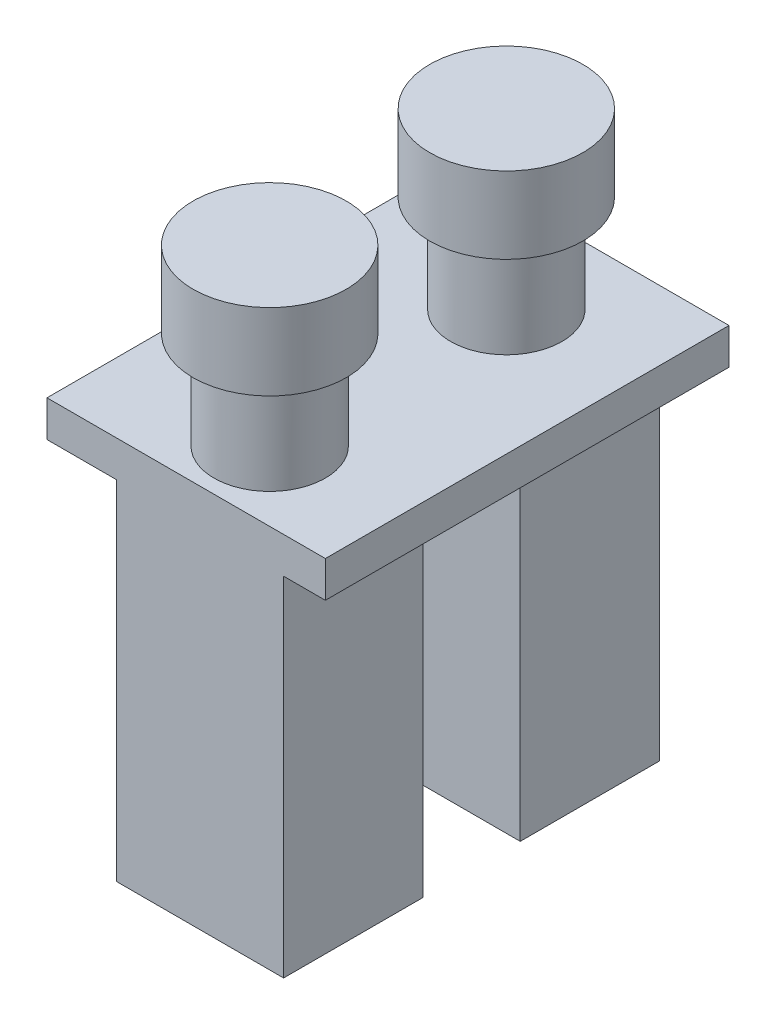
ISO-10303-21;
HEADER;
FILE_DESCRIPTION(('STEP AP214'),'2;1');
FILE_NAME('part.step','',(''),(''),'','','');
FILE_SCHEMA(('AUTOMOTIVE_DESIGN { 1 0 10303 214 1 1 1 1 }'));
ENDSEC;
DATA;
#1=APPLICATION_CONTEXT('core data for automotive mechanical design processes');
#2=APPLICATION_PROTOCOL_DEFINITION('international standard','automotive_design',2000,#1);
#3=PRODUCT_CONTEXT('',#1,'mechanical');
#4=PRODUCT('Part','Part','',(#3));
#5=PRODUCT_RELATED_PRODUCT_CATEGORY('part','',(#4));
#6=PRODUCT_DEFINITION_FORMATION('','',#4);
#7=PRODUCT_DEFINITION_CONTEXT('part definition',#1,'design');
#8=PRODUCT_DEFINITION('design','',#6,#7);
#9=PRODUCT_DEFINITION_SHAPE('','',#8);
#10=(LENGTH_UNIT() NAMED_UNIT(*) SI_UNIT(.MILLI.,.METRE.));
#11=(NAMED_UNIT(*) PLANE_ANGLE_UNIT() SI_UNIT($,.RADIAN.));
#12=(NAMED_UNIT(*) SI_UNIT($,.STERADIAN.) SOLID_ANGLE_UNIT());
#13=UNCERTAINTY_MEASURE_WITH_UNIT(LENGTH_MEASURE(1.E-05),#10,'distance_accuracy_value','');
#14=(GEOMETRIC_REPRESENTATION_CONTEXT(3) GLOBAL_UNCERTAINTY_ASSIGNED_CONTEXT((#13)) GLOBAL_UNIT_ASSIGNED_CONTEXT((#10,
#11,#12)) REPRESENTATION_CONTEXT('',''));
#15=CARTESIAN_POINT('',(0.,0.,0.));
#16=DIRECTION('',(0.,0.,1.));
#17=DIRECTION('',(1.,0.,0.));
#18=AXIS2_PLACEMENT_3D('',#15,#16,#17);
#19=CARTESIAN_POINT('',(0.,0.,0.));
#20=DIRECTION('',(0.,-1.,0.));
#21=DIRECTION('',(0.,0.,-1.));
#22=AXIS2_PLACEMENT_3D('',#19,#20,#21);
#23=PLANE('',#22);
#24=DIRECTION('',(1.,0.,0.));
#25=VECTOR('',#24,1.);
#26=CARTESIAN_POINT('',(5.,0.,-27.));
#27=LINE('',#26,#25);
#28=CARTESIAN_POINT('',(5.,0.,-27.));
#29=VERTEX_POINT('',#28);
#30=CARTESIAN_POINT('',(17.,0.,-27.));
#31=VERTEX_POINT('',#30);
#32=EDGE_CURVE('E162',#29,#31,#27,.T.);
#33=ORIENTED_EDGE('',*,*,#32,.F.);
#34=DIRECTION('',(0.,0.,-1.));
#35=VECTOR('',#34,1.);
#36=CARTESIAN_POINT('',(5.,0.,-27.));
#37=LINE('',#36,#35);
#38=CARTESIAN_POINT('',(5.,0.,-17.));
#39=VERTEX_POINT('',#38);
#40=EDGE_CURVE('E157',#39,#29,#37,.T.);
#41=ORIENTED_EDGE('',*,*,#40,.F.);
#42=DIRECTION('',(-1.,0.,0.));
#43=VECTOR('',#42,1.);
#44=CARTESIAN_POINT('',(5.,0.,-17.));
#45=LINE('',#44,#43);
#46=CARTESIAN_POINT('',(17.,0.,-17.));
#47=VERTEX_POINT('',#46);
#48=EDGE_CURVE('E172',#47,#39,#45,.T.);
#49=ORIENTED_EDGE('',*,*,#48,.F.);
#50=DIRECTION('',(0.,0.,1.));
#51=VECTOR('',#50,1.);
#52=CARTESIAN_POINT('',(17.,0.,-27.));
#53=LINE('',#52,#51);
#54=EDGE_CURVE('E184',#31,#47,#53,.T.);
#55=ORIENTED_EDGE('',*,*,#54,.F.);
#56=EDGE_LOOP('',(#33,#41,#49,#55));
#57=FACE_BOUND('',#56,.T.);
#58=DIRECTION('',(1.,0.,0.));
#59=VECTOR('',#58,1.);
#60=CARTESIAN_POINT('',(5.,0.,-10.));
#61=LINE('',#60,#59);
#62=CARTESIAN_POINT('',(5.,0.,-10.));
#63=VERTEX_POINT('',#62);
#64=CARTESIAN_POINT('',(17.,0.,-10.));
#65=VERTEX_POINT('',#64);
#66=EDGE_CURVE('E298',#63,#65,#61,.T.);
#67=ORIENTED_EDGE('',*,*,#66,.F.);
#68=DIRECTION('',(0.,0.,-1.));
#69=VECTOR('',#68,1.);
#70=CARTESIAN_POINT('',(5.,0.,-10.));
#71=LINE('',#70,#69);
#72=CARTESIAN_POINT('',(5.,0.,0.));
#73=VERTEX_POINT('',#72);
#74=EDGE_CURVE('E154',#73,#63,#71,.T.);
#75=ORIENTED_EDGE('',*,*,#74,.F.);
#76=DIRECTION('',(1.,0.,0.));
#77=VECTOR('',#76,1.);
#78=CARTESIAN_POINT('',(0.,0.,0.));
#79=LINE('',#78,#77);
#80=CARTESIAN_POINT('',(0.,0.,0.));
#81=VERTEX_POINT('',#80);
#82=EDGE_CURVE('E245',#81,#73,#79,.T.);
#83=ORIENTED_EDGE('',*,*,#82,.F.);
#84=DIRECTION('',(0.,0.,1.));
#85=VECTOR('',#84,1.);
#86=CARTESIAN_POINT('',(0.,0.,0.));
#87=LINE('',#86,#85);
#88=CARTESIAN_POINT('',(0.,0.,-29.));
#89=VERTEX_POINT('',#88);
#90=EDGE_CURVE('E225',#89,#81,#87,.T.);
#91=ORIENTED_EDGE('',*,*,#90,.F.);
#92=DIRECTION('',(-1.,0.,0.));
#93=VECTOR('',#92,1.);
#94=CARTESIAN_POINT('',(0.,0.,-29.));
#95=LINE('',#94,#93);
#96=CARTESIAN_POINT('',(20.,0.,-29.));
#97=VERTEX_POINT('',#96);
#98=EDGE_CURVE('E231',#97,#89,#95,.T.);
#99=ORIENTED_EDGE('',*,*,#98,.F.);
#100=DIRECTION('',(0.,0.,-1.));
#101=VECTOR('',#100,1.);
#102=CARTESIAN_POINT('',(20.,0.,0.));
#103=LINE('',#102,#101);
#104=CARTESIAN_POINT('',(20.,0.,0.));
#105=VERTEX_POINT('',#104);
#106=EDGE_CURVE('E249',#105,#97,#103,.T.);
#107=ORIENTED_EDGE('',*,*,#106,.F.);
#108=CARTESIAN_POINT('',(17.,0.,0.));
#109=VERTEX_POINT('',#108);
#110=EDGE_CURVE('E244',#109,#105,#79,.T.);
#111=ORIENTED_EDGE('',*,*,#110,.F.);
#112=DIRECTION('',(0.,0.,1.));
#113=VECTOR('',#112,1.);
#114=CARTESIAN_POINT('',(17.,0.,-10.));
#115=LINE('',#114,#113);
#116=EDGE_CURVE('E150',#65,#109,#115,.T.);
#117=ORIENTED_EDGE('',*,*,#116,.F.);
#118=EDGE_LOOP('',(#67,#75,#83,#91,#99,#107,#111,#117));
#119=FACE_BOUND('',#118,.T.);
#120=ADVANCED_FACE('F39',(#57,#119),#23,.T.);
#121=CARTESIAN_POINT('',(0.,2.6,0.));
#122=DIRECTION('',(1.,0.,0.));
#123=DIRECTION('',(0.,0.,-1.));
#124=AXIS2_PLACEMENT_3D('',#121,#122,#123);
#125=PLANE('',#124);
#126=ORIENTED_EDGE('',*,*,#90,.T.);
#127=DIRECTION('',(0.,-1.,0.));
#128=VECTOR('',#127,1.);
#129=CARTESIAN_POINT('',(0.,2.6,0.));
#130=LINE('',#129,#128);
#131=CARTESIAN_POINT('',(0.,2.6,0.));
#132=VERTEX_POINT('',#131);
#133=EDGE_CURVE('E265',#132,#81,#130,.T.);
#134=ORIENTED_EDGE('',*,*,#133,.F.);
#135=DIRECTION('',(0.,0.,1.));
#136=VECTOR('',#135,1.);
#137=CARTESIAN_POINT('',(0.,2.6,0.));
#138=LINE('',#137,#136);
#139=CARTESIAN_POINT('',(0.,2.6,-29.));
#140=VERTEX_POINT('',#139);
#141=EDGE_CURVE('E226',#140,#132,#138,.T.);
#142=ORIENTED_EDGE('',*,*,#141,.F.);
#143=DIRECTION('',(0.,-1.,0.));
#144=VECTOR('',#143,1.);
#145=CARTESIAN_POINT('',(0.,2.6,-29.));
#146=LINE('',#145,#144);
#147=EDGE_CURVE('E240',#140,#89,#146,.T.);
#148=ORIENTED_EDGE('',*,*,#147,.T.);
#149=EDGE_LOOP('',(#126,#134,#142,#148));
#150=FACE_BOUND('',#149,.T.);
#151=ADVANCED_FACE('F41',(#150),#125,.F.);
#152=CARTESIAN_POINT('',(0.,2.6,0.));
#153=DIRECTION('',(0.,0.,-1.));
#154=DIRECTION('',(-1.,0.,0.));
#155=AXIS2_PLACEMENT_3D('',#152,#153,#154);
#156=PLANE('',#155);
#157=ORIENTED_EDGE('',*,*,#82,.T.);
#158=DIRECTION('',(0.,1.,0.));
#159=VECTOR('',#158,1.);
#160=CARTESIAN_POINT('',(5.,-25.,0.));
#161=LINE('',#160,#159);
#162=CARTESIAN_POINT('',(5.,-25.,0.));
#163=VERTEX_POINT('',#162);
#164=EDGE_CURVE('E308',#163,#73,#161,.T.);
#165=ORIENTED_EDGE('',*,*,#164,.F.);
#166=DIRECTION('',(-1.,0.,0.));
#167=VECTOR('',#166,1.);
#168=CARTESIAN_POINT('',(5.,-25.,0.));
#169=LINE('',#168,#167);
#170=CARTESIAN_POINT('',(17.,-25.,0.));
#171=VERTEX_POINT('',#170);
#172=EDGE_CURVE('E146',#171,#163,#169,.T.);
#173=ORIENTED_EDGE('',*,*,#172,.F.);
#174=DIRECTION('',(0.,1.,0.));
#175=VECTOR('',#174,1.);
#176=CARTESIAN_POINT('',(17.,-25.,0.));
#177=LINE('',#176,#175);
#178=EDGE_CURVE('E55',#171,#109,#177,.T.);
#179=ORIENTED_EDGE('',*,*,#178,.T.);
#180=ORIENTED_EDGE('',*,*,#110,.T.);
#181=DIRECTION('',(0.,-1.,0.));
#182=VECTOR('',#181,1.);
#183=CARTESIAN_POINT('',(20.,2.6,0.));
#184=LINE('',#183,#182);
#185=CARTESIAN_POINT('',(20.,2.6,0.));
#186=VERTEX_POINT('',#185);
#187=EDGE_CURVE('E261',#186,#105,#184,.T.);
#188=ORIENTED_EDGE('',*,*,#187,.F.);
#189=DIRECTION('',(1.,0.,0.));
#190=VECTOR('',#189,1.);
#191=CARTESIAN_POINT('',(0.,2.6,0.));
#192=LINE('',#191,#190);
#193=EDGE_CURVE('E230',#132,#186,#192,.T.);
#194=ORIENTED_EDGE('',*,*,#193,.F.);
#195=ORIENTED_EDGE('',*,*,#133,.T.);
#196=EDGE_LOOP('',(#157,#165,#173,#179,#180,#188,#194,#195));
#197=FACE_BOUND('',#196,.T.);
#198=ADVANCED_FACE('F287',(#197),#156,.F.);
#199=CARTESIAN_POINT('',(20.,2.6,0.));
#200=DIRECTION('',(-1.,0.,0.));
#201=DIRECTION('',(0.,0.,1.));
#202=AXIS2_PLACEMENT_3D('',#199,#200,#201);
#203=PLANE('',#202);
#204=ORIENTED_EDGE('',*,*,#106,.T.);
#205=DIRECTION('',(0.,-1.,0.));
#206=VECTOR('',#205,1.);
#207=CARTESIAN_POINT('',(20.,2.6,-29.));
#208=LINE('',#207,#206);
#209=CARTESIAN_POINT('',(20.,2.6,-29.));
#210=VERTEX_POINT('',#209);
#211=EDGE_CURVE('E257',#210,#97,#208,.T.);
#212=ORIENTED_EDGE('',*,*,#211,.F.);
#213=DIRECTION('',(0.,0.,-1.));
#214=VECTOR('',#213,1.);
#215=CARTESIAN_POINT('',(20.,2.6,0.));
#216=LINE('',#215,#214);
#217=EDGE_CURVE('E234',#186,#210,#216,.T.);
#218=ORIENTED_EDGE('',*,*,#217,.F.);
#219=ORIENTED_EDGE('',*,*,#187,.T.);
#220=EDGE_LOOP('',(#204,#212,#218,#219));
#221=FACE_BOUND('',#220,.T.);
#222=ADVANCED_FACE('F293',(#221),#203,.F.);
#223=CARTESIAN_POINT('',(0.,2.6,-29.));
#224=DIRECTION('',(0.,0.,1.));
#225=DIRECTION('',(1.,0.,0.));
#226=AXIS2_PLACEMENT_3D('',#223,#224,#225);
#227=PLANE('',#226);
#228=ORIENTED_EDGE('',*,*,#98,.T.);
#229=ORIENTED_EDGE('',*,*,#147,.F.);
#230=DIRECTION('',(-1.,0.,0.));
#231=VECTOR('',#230,1.);
#232=CARTESIAN_POINT('',(0.,2.6,-29.));
#233=LINE('',#232,#231);
#234=EDGE_CURVE('E237',#210,#140,#233,.T.);
#235=ORIENTED_EDGE('',*,*,#234,.F.);
#236=ORIENTED_EDGE('',*,*,#211,.T.);
#237=EDGE_LOOP('',(#228,#229,#235,#236));
#238=FACE_BOUND('',#237,.T.);
#239=ADVANCED_FACE('F277',(#238),#227,.F.);
#240=CARTESIAN_POINT('',(0.,2.6,0.));
#241=DIRECTION('',(0.,-1.,0.));
#242=DIRECTION('',(0.,0.,-1.));
#243=AXIS2_PLACEMENT_3D('',#240,#241,#242);
#244=PLANE('',#243);
#245=CARTESIAN_POINT('',(11.,2.6,-22.));
#246=DIRECTION('',(0.,-1.,0.));
#247=DIRECTION('',(0.,0.,-1.));
#248=AXIS2_PLACEMENT_3D('',#245,#246,#247);
#249=CIRCLE('',#248,4.);
#250=CARTESIAN_POINT('',(11.,2.6,-26.));
#251=VERTEX_POINT('',#250);
#252=EDGE_CURVE('E11',#251,#251,#249,.F.);
#253=ORIENTED_EDGE('',*,*,#252,.F.);
#254=EDGE_LOOP('',(#253));
#255=FACE_BOUND('',#254,.T.);
#256=CARTESIAN_POINT('',(11.,2.6,-5.));
#257=DIRECTION('',(0.,-1.,0.));
#258=DIRECTION('',(0.,0.,-1.));
#259=AXIS2_PLACEMENT_3D('',#256,#257,#258);
#260=CIRCLE('',#259,4.);
#261=CARTESIAN_POINT('',(11.,2.6,-9.));
#262=VERTEX_POINT('',#261);
#263=EDGE_CURVE('E48',#262,#262,#260,.F.);
#264=ORIENTED_EDGE('',*,*,#263,.F.);
#265=EDGE_LOOP('',(#264));
#266=FACE_BOUND('',#265,.T.);
#267=ORIENTED_EDGE('',*,*,#141,.T.);
#268=ORIENTED_EDGE('',*,*,#193,.T.);
#269=ORIENTED_EDGE('',*,*,#217,.T.);
#270=ORIENTED_EDGE('',*,*,#234,.T.);
#271=EDGE_LOOP('',(#267,#268,#269,#270));
#272=FACE_BOUND('',#271,.T.);
#273=ADVANCED_FACE('F274',(#255,#266,#272),#244,.F.);
#274=CARTESIAN_POINT('',(11.,9.6,-5.));
#275=DIRECTION('',(0.,-1.,0.));
#276=DIRECTION('',(0.,0.,-1.));
#277=AXIS2_PLACEMENT_3D('',#274,#275,#276);
#278=CYLINDRICAL_SURFACE('',#277,4.);
#279=CARTESIAN_POINT('',(11.,9.6,-5.));
#280=DIRECTION('',(0.,1.,0.));
#281=DIRECTION('',(0.,0.,1.));
#282=AXIS2_PLACEMENT_3D('',#279,#280,#281);
#283=CIRCLE('',#282,4.);
#284=CARTESIAN_POINT('',(11.,9.6,-0.999999999999997));
#285=VERTEX_POINT('',#284);
#286=EDGE_CURVE('E221',#285,#285,#283,.T.);
#287=ORIENTED_EDGE('',*,*,#286,.F.);
#288=EDGE_LOOP('',(#287));
#289=FACE_BOUND('',#288,.T.);
#290=ORIENTED_EDGE('',*,*,#263,.T.);
#291=EDGE_LOOP('',(#290));
#292=FACE_BOUND('',#291,.T.);
#293=ADVANCED_FACE('F272',(#289,#292),#278,.T.);
#294=CARTESIAN_POINT('',(11.,9.6,-22.));
#295=DIRECTION('',(0.,-1.,0.));
#296=DIRECTION('',(0.,0.,-1.));
#297=AXIS2_PLACEMENT_3D('',#294,#295,#296);
#298=CYLINDRICAL_SURFACE('',#297,4.);
#299=CARTESIAN_POINT('',(11.,9.6,-22.));
#300=DIRECTION('',(0.,1.,0.));
#301=DIRECTION('',(0.,0.,1.));
#302=AXIS2_PLACEMENT_3D('',#299,#300,#301);
#303=CIRCLE('',#302,4.);
#304=CARTESIAN_POINT('',(11.,9.6,-18.));
#305=VERTEX_POINT('',#304);
#306=EDGE_CURVE('E214',#305,#305,#303,.T.);
#307=ORIENTED_EDGE('',*,*,#306,.F.);
#308=EDGE_LOOP('',(#307));
#309=FACE_BOUND('',#308,.T.);
#310=ORIENTED_EDGE('',*,*,#252,.T.);
#311=EDGE_LOOP('',(#310));
#312=FACE_BOUND('',#311,.T.);
#313=ADVANCED_FACE('F360',(#309,#312),#298,.T.);
#314=CARTESIAN_POINT('',(11.,15.1,-22.));
#315=DIRECTION('',(0.,-1.,0.));
#316=DIRECTION('',(0.,0.,-1.));
#317=AXIS2_PLACEMENT_3D('',#314,#315,#316);
#318=CYLINDRICAL_SURFACE('',#317,5.5);
#319=CARTESIAN_POINT('',(11.,15.1,-22.));
#320=DIRECTION('',(0.,1.,0.));
#321=DIRECTION('',(0.,0.,1.));
#322=AXIS2_PLACEMENT_3D('',#319,#320,#321);
#323=CIRCLE('',#322,5.5);
#324=CARTESIAN_POINT('',(11.,15.1,-16.5));
#325=VERTEX_POINT('',#324);
#326=EDGE_CURVE('E210',#325,#325,#323,.T.);
#327=ORIENTED_EDGE('',*,*,#326,.F.);
#328=EDGE_LOOP('',(#327));
#329=FACE_BOUND('',#328,.T.);
#330=CARTESIAN_POINT('',(11.,9.6,-22.));
#331=DIRECTION('',(0.,1.,0.));
#332=DIRECTION('',(0.,0.,1.));
#333=AXIS2_PLACEMENT_3D('',#330,#331,#332);
#334=CIRCLE('',#333,5.5);
#335=CARTESIAN_POINT('',(11.,9.6,-16.5));
#336=VERTEX_POINT('',#335);
#337=EDGE_CURVE('E206',#336,#336,#334,.T.);
#338=ORIENTED_EDGE('',*,*,#337,.T.);
#339=EDGE_LOOP('',(#338));
#340=FACE_BOUND('',#339,.T.);
#341=ADVANCED_FACE('F367',(#329,#340),#318,.T.);
#342=CARTESIAN_POINT('',(11.,15.1,-22.));
#343=DIRECTION('',(0.,1.,0.));
#344=DIRECTION('',(0.,0.,1.));
#345=AXIS2_PLACEMENT_3D('',#342,#343,#344);
#346=PLANE('',#345);
#347=ORIENTED_EDGE('',*,*,#326,.T.);
#348=EDGE_LOOP('',(#347));
#349=FACE_BOUND('',#348,.T.);
#350=ADVANCED_FACE('F375',(#349),#346,.T.);
#351=CARTESIAN_POINT('',(11.,9.6,-22.));
#352=DIRECTION('',(0.,1.,0.));
#353=DIRECTION('',(0.,0.,1.));
#354=AXIS2_PLACEMENT_3D('',#351,#352,#353);
#355=PLANE('',#354);
#356=ORIENTED_EDGE('',*,*,#306,.T.);
#357=EDGE_LOOP('',(#356));
#358=FACE_BOUND('',#357,.T.);
#359=ORIENTED_EDGE('',*,*,#337,.F.);
#360=EDGE_LOOP('',(#359));
#361=FACE_BOUND('',#360,.T.);
#362=ADVANCED_FACE('F383',(#358,#361),#355,.F.);
#363=CARTESIAN_POINT('',(11.,15.1,-5.));
#364=DIRECTION('',(0.,-1.,0.));
#365=DIRECTION('',(0.,0.,-1.));
#366=AXIS2_PLACEMENT_3D('',#363,#364,#365);
#367=CYLINDRICAL_SURFACE('',#366,5.5);
#368=CARTESIAN_POINT('',(11.,15.1,-5.));
#369=DIRECTION('',(0.,1.,0.));
#370=DIRECTION('',(0.,0.,1.));
#371=AXIS2_PLACEMENT_3D('',#368,#369,#370);
#372=CIRCLE('',#371,5.5);
#373=CARTESIAN_POINT('',(11.,15.1,0.5));
#374=VERTEX_POINT('',#373);
#375=EDGE_CURVE('E202',#374,#374,#372,.T.);
#376=ORIENTED_EDGE('',*,*,#375,.F.);
#377=EDGE_LOOP('',(#376));
#378=FACE_BOUND('',#377,.T.);
#379=CARTESIAN_POINT('',(11.,9.6,-5.));
#380=DIRECTION('',(0.,1.,0.));
#381=DIRECTION('',(0.,0.,1.));
#382=AXIS2_PLACEMENT_3D('',#379,#380,#381);
#383=CIRCLE('',#382,5.5);
#384=CARTESIAN_POINT('',(11.,9.6,0.5));
#385=VERTEX_POINT('',#384);
#386=EDGE_CURVE('E201',#385,#385,#383,.T.);
#387=ORIENTED_EDGE('',*,*,#386,.T.);
#388=EDGE_LOOP('',(#387));
#389=FACE_BOUND('',#388,.T.);
#390=ADVANCED_FACE('F391',(#378,#389),#367,.T.);
#391=CARTESIAN_POINT('',(11.,15.1,-5.));
#392=DIRECTION('',(0.,1.,0.));
#393=DIRECTION('',(0.,0.,1.));
#394=AXIS2_PLACEMENT_3D('',#391,#392,#393);
#395=PLANE('',#394);
#396=ORIENTED_EDGE('',*,*,#375,.T.);
#397=EDGE_LOOP('',(#396));
#398=FACE_BOUND('',#397,.T.);
#399=ADVANCED_FACE('F399',(#398),#395,.T.);
#400=CARTESIAN_POINT('',(11.,9.6,-5.));
#401=DIRECTION('',(0.,1.,0.));
#402=DIRECTION('',(0.,0.,1.));
#403=AXIS2_PLACEMENT_3D('',#400,#401,#402);
#404=PLANE('',#403);
#405=ORIENTED_EDGE('',*,*,#286,.T.);
#406=EDGE_LOOP('',(#405));
#407=FACE_BOUND('',#406,.T.);
#408=ORIENTED_EDGE('',*,*,#386,.F.);
#409=EDGE_LOOP('',(#408));
#410=FACE_BOUND('',#409,.T.);
#411=ADVANCED_FACE('F407',(#407,#410),#404,.F.);
#412=CARTESIAN_POINT('',(5.,-25.,-27.));
#413=DIRECTION('',(1.,0.,0.));
#414=DIRECTION('',(0.,0.,-1.));
#415=AXIS2_PLACEMENT_3D('',#412,#413,#414);
#416=PLANE('',#415);
#417=ORIENTED_EDGE('',*,*,#40,.T.);
#418=DIRECTION('',(0.,1.,0.));
#419=VECTOR('',#418,1.);
#420=CARTESIAN_POINT('',(5.,-25.,-27.));
#421=LINE('',#420,#419);
#422=CARTESIAN_POINT('',(5.,-25.,-27.));
#423=VERTEX_POINT('',#422);
#424=EDGE_CURVE('E198',#423,#29,#421,.T.);
#425=ORIENTED_EDGE('',*,*,#424,.F.);
#426=DIRECTION('',(0.,0.,-1.));
#427=VECTOR('',#426,1.);
#428=CARTESIAN_POINT('',(5.,-25.,-27.));
#429=LINE('',#428,#427);
#430=CARTESIAN_POINT('',(5.,-25.,-17.));
#431=VERTEX_POINT('',#430);
#432=EDGE_CURVE('E167',#431,#423,#429,.T.);
#433=ORIENTED_EDGE('',*,*,#432,.F.);
#434=DIRECTION('',(0.,1.,0.));
#435=VECTOR('',#434,1.);
#436=CARTESIAN_POINT('',(5.,-25.,-17.));
#437=LINE('',#436,#435);
#438=EDGE_CURVE('E180',#431,#39,#437,.T.);
#439=ORIENTED_EDGE('',*,*,#438,.T.);
#440=EDGE_LOOP('',(#417,#425,#433,#439));
#441=FACE_BOUND('',#440,.T.);
#442=ADVANCED_FACE('F415',(#441),#416,.F.);
#443=CARTESIAN_POINT('',(5.,-25.,-27.));
#444=DIRECTION('',(0.,0.,1.));
#445=DIRECTION('',(1.,0.,0.));
#446=AXIS2_PLACEMENT_3D('',#443,#444,#445);
#447=PLANE('',#446);
#448=ORIENTED_EDGE('',*,*,#32,.T.);
#449=DIRECTION('',(0.,1.,0.));
#450=VECTOR('',#449,1.);
#451=CARTESIAN_POINT('',(17.,-25.,-27.));
#452=LINE('',#451,#450);
#453=CARTESIAN_POINT('',(17.,-25.,-27.));
#454=VERTEX_POINT('',#453);
#455=EDGE_CURVE('E194',#454,#31,#452,.T.);
#456=ORIENTED_EDGE('',*,*,#455,.F.);
#457=DIRECTION('',(1.,0.,0.));
#458=VECTOR('',#457,1.);
#459=CARTESIAN_POINT('',(5.,-25.,-27.));
#460=LINE('',#459,#458);
#461=EDGE_CURVE('E171',#423,#454,#460,.T.);
#462=ORIENTED_EDGE('',*,*,#461,.F.);
#463=ORIENTED_EDGE('',*,*,#424,.T.);
#464=EDGE_LOOP('',(#448,#456,#462,#463));
#465=FACE_BOUND('',#464,.T.);
#466=ADVANCED_FACE('F422',(#465),#447,.F.);
#467=CARTESIAN_POINT('',(17.,-25.,-27.));
#468=DIRECTION('',(-1.,0.,0.));
#469=DIRECTION('',(0.,0.,1.));
#470=AXIS2_PLACEMENT_3D('',#467,#468,#469);
#471=PLANE('',#470);
#472=ORIENTED_EDGE('',*,*,#54,.T.);
#473=DIRECTION('',(0.,1.,0.));
#474=VECTOR('',#473,1.);
#475=CARTESIAN_POINT('',(17.,-25.,-17.));
#476=LINE('',#475,#474);
#477=CARTESIAN_POINT('',(17.,-25.,-17.));
#478=VERTEX_POINT('',#477);
#479=EDGE_CURVE('E63',#478,#47,#476,.T.);
#480=ORIENTED_EDGE('',*,*,#479,.F.);
#481=DIRECTION('',(0.,0.,1.));
#482=VECTOR('',#481,1.);
#483=CARTESIAN_POINT('',(17.,-25.,-27.));
#484=LINE('',#483,#482);
#485=EDGE_CURVE('E175',#454,#478,#484,.T.);
#486=ORIENTED_EDGE('',*,*,#485,.F.);
#487=ORIENTED_EDGE('',*,*,#455,.T.);
#488=EDGE_LOOP('',(#472,#480,#486,#487));
#489=FACE_BOUND('',#488,.T.);
#490=ADVANCED_FACE('F430',(#489),#471,.F.);
#491=CARTESIAN_POINT('',(5.,-25.,-17.));
#492=DIRECTION('',(0.,0.,-1.));
#493=DIRECTION('',(-1.,0.,0.));
#494=AXIS2_PLACEMENT_3D('',#491,#492,#493);
#495=PLANE('',#494);
#496=ORIENTED_EDGE('',*,*,#48,.T.);
#497=ORIENTED_EDGE('',*,*,#438,.F.);
#498=DIRECTION('',(-1.,0.,0.));
#499=VECTOR('',#498,1.);
#500=CARTESIAN_POINT('',(5.,-25.,-17.));
#501=LINE('',#500,#499);
#502=EDGE_CURVE('E178',#478,#431,#501,.T.);
#503=ORIENTED_EDGE('',*,*,#502,.F.);
#504=ORIENTED_EDGE('',*,*,#479,.T.);
#505=EDGE_LOOP('',(#496,#497,#503,#504));
#506=FACE_BOUND('',#505,.T.);
#507=ADVANCED_FACE('F438',(#506),#495,.F.);
#508=CARTESIAN_POINT('',(0.,-25.,0.));
#509=DIRECTION('',(0.,1.,0.));
#510=DIRECTION('',(0.,0.,1.));
#511=AXIS2_PLACEMENT_3D('',#508,#509,#510);
#512=PLANE('',#511);
#513=ORIENTED_EDGE('',*,*,#432,.T.);
#514=ORIENTED_EDGE('',*,*,#461,.T.);
#515=ORIENTED_EDGE('',*,*,#485,.T.);
#516=ORIENTED_EDGE('',*,*,#502,.T.);
#517=EDGE_LOOP('',(#513,#514,#515,#516));
#518=FACE_BOUND('',#517,.T.);
#519=ADVANCED_FACE('F446',(#518),#512,.F.);
#520=CARTESIAN_POINT('',(5.,-25.,-10.));
#521=DIRECTION('',(1.,0.,0.));
#522=DIRECTION('',(0.,0.,-1.));
#523=AXIS2_PLACEMENT_3D('',#520,#521,#522);
#524=PLANE('',#523);
#525=ORIENTED_EDGE('',*,*,#74,.T.);
#526=DIRECTION('',(0.,1.,0.));
#527=VECTOR('',#526,1.);
#528=CARTESIAN_POINT('',(5.,-25.,-10.));
#529=LINE('',#528,#527);
#530=CARTESIAN_POINT('',(5.,-25.,-10.));
#531=VERTEX_POINT('',#530);
#532=EDGE_CURVE('E134',#531,#63,#529,.T.);
#533=ORIENTED_EDGE('',*,*,#532,.F.);
#534=DIRECTION('',(0.,0.,-1.));
#535=VECTOR('',#534,1.);
#536=CARTESIAN_POINT('',(5.,-25.,-10.));
#537=LINE('',#536,#535);
#538=EDGE_CURVE('E142',#163,#531,#537,.T.);
#539=ORIENTED_EDGE('',*,*,#538,.F.);
#540=ORIENTED_EDGE('',*,*,#164,.T.);
#541=EDGE_LOOP('',(#525,#533,#539,#540));
#542=FACE_BOUND('',#541,.T.);
#543=ADVANCED_FACE('F152',(#542),#524,.F.);
#544=CARTESIAN_POINT('',(5.,-25.,-10.));
#545=DIRECTION('',(0.,0.,1.));
#546=DIRECTION('',(1.,0.,0.));
#547=AXIS2_PLACEMENT_3D('',#544,#545,#546);
#548=PLANE('',#547);
#549=ORIENTED_EDGE('',*,*,#66,.T.);
#550=DIRECTION('',(0.,1.,0.));
#551=VECTOR('',#550,1.);
#552=CARTESIAN_POINT('',(17.,-25.,-10.));
#553=LINE('',#552,#551);
#554=CARTESIAN_POINT('',(17.,-25.,-10.));
#555=VERTEX_POINT('',#554);
#556=EDGE_CURVE('E137',#555,#65,#553,.T.);
#557=ORIENTED_EDGE('',*,*,#556,.F.);
#558=DIRECTION('',(1.,0.,0.));
#559=VECTOR('',#558,1.);
#560=CARTESIAN_POINT('',(5.,-25.,-10.));
#561=LINE('',#560,#559);
#562=EDGE_CURVE('E130',#531,#555,#561,.T.);
#563=ORIENTED_EDGE('',*,*,#562,.F.);
#564=ORIENTED_EDGE('',*,*,#532,.T.);
#565=EDGE_LOOP('',(#549,#557,#563,#564));
#566=FACE_BOUND('',#565,.T.);
#567=ADVANCED_FACE('F132',(#566),#548,.F.);
#568=CARTESIAN_POINT('',(17.,-25.,-10.));
#569=DIRECTION('',(-1.,0.,0.));
#570=DIRECTION('',(0.,0.,1.));
#571=AXIS2_PLACEMENT_3D('',#568,#569,#570);
#572=PLANE('',#571);
#573=ORIENTED_EDGE('',*,*,#116,.T.);
#574=ORIENTED_EDGE('',*,*,#178,.F.);
#575=DIRECTION('',(0.,0.,1.));
#576=VECTOR('',#575,1.);
#577=CARTESIAN_POINT('',(17.,-25.,-10.));
#578=LINE('',#577,#576);
#579=EDGE_CURVE('E141',#555,#171,#578,.T.);
#580=ORIENTED_EDGE('',*,*,#579,.F.);
#581=ORIENTED_EDGE('',*,*,#556,.T.);
#582=EDGE_LOOP('',(#573,#574,#580,#581));
#583=FACE_BOUND('',#582,.T.);
#584=ADVANCED_FACE('F314',(#583),#572,.F.);
#585=CARTESIAN_POINT('',(0.,-25.,0.));
#586=DIRECTION('',(0.,1.,0.));
#587=DIRECTION('',(0.,0.,1.));
#588=AXIS2_PLACEMENT_3D('',#585,#586,#587);
#589=PLANE('',#588);
#590=ORIENTED_EDGE('',*,*,#538,.T.);
#591=ORIENTED_EDGE('',*,*,#562,.T.);
#592=ORIENTED_EDGE('',*,*,#579,.T.);
#593=ORIENTED_EDGE('',*,*,#172,.T.);
#594=EDGE_LOOP('',(#590,#591,#592,#593));
#595=FACE_BOUND('',#594,.T.);
#596=ADVANCED_FACE('F145',(#595),#589,.F.);
#597=CLOSED_SHELL('',(#120,#151,#198,#222,#239,#273,#293,#313,#341,#350,#362,#390,#399,#411,
#442,#466,#490,#507,#519,#543,#567,#584,#596));
#598=MANIFOLD_SOLID_BREP('B2',#597);
#599=ADVANCED_BREP_SHAPE_REPRESENTATION('',(#18,#598),#14);
#600=SHAPE_DEFINITION_REPRESENTATION(#9,#599);
ENDSEC;
END-ISO-10303-21;
